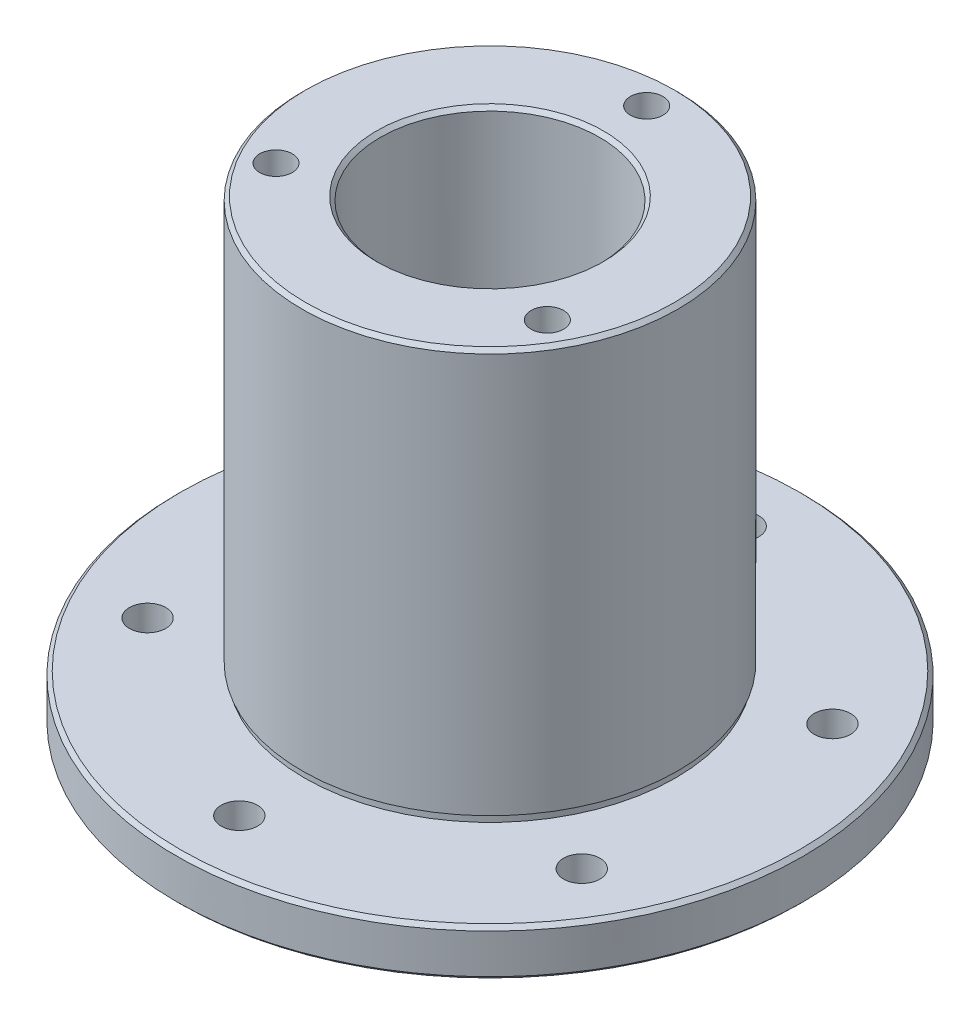
ISO-10303-21;
HEADER;
FILE_DESCRIPTION(('STEP AP214'),'2;1');
FILE_NAME('part.step','',(''),(''),'','','');
FILE_SCHEMA(('AUTOMOTIVE_DESIGN { 1 0 10303 214 1 1 1 1 }'));
ENDSEC;
DATA;
#1=APPLICATION_CONTEXT('core data for automotive mechanical design processes');
#2=APPLICATION_PROTOCOL_DEFINITION('international standard','automotive_design',2000,#1);
#3=PRODUCT_CONTEXT('',#1,'mechanical');
#4=PRODUCT('Part','Part','',(#3));
#5=PRODUCT_RELATED_PRODUCT_CATEGORY('part','',(#4));
#6=PRODUCT_DEFINITION_FORMATION('','',#4);
#7=PRODUCT_DEFINITION_CONTEXT('part definition',#1,'design');
#8=PRODUCT_DEFINITION('design','',#6,#7);
#9=PRODUCT_DEFINITION_SHAPE('','',#8);
#10=(LENGTH_UNIT() NAMED_UNIT(*) SI_UNIT(.MILLI.,.METRE.));
#11=(NAMED_UNIT(*) PLANE_ANGLE_UNIT() SI_UNIT($,.RADIAN.));
#12=(NAMED_UNIT(*) SI_UNIT($,.STERADIAN.) SOLID_ANGLE_UNIT());
#13=UNCERTAINTY_MEASURE_WITH_UNIT(LENGTH_MEASURE(1.E-05),#10,'distance_accuracy_value','');
#14=(GEOMETRIC_REPRESENTATION_CONTEXT(3) GLOBAL_UNCERTAINTY_ASSIGNED_CONTEXT((#13)) GLOBAL_UNIT_ASSIGNED_CONTEXT((#10,
#11,#12)) REPRESENTATION_CONTEXT('',''));
#15=CARTESIAN_POINT('',(0.,0.,0.));
#16=DIRECTION('',(0.,0.,1.));
#17=DIRECTION('',(1.,0.,0.));
#18=AXIS2_PLACEMENT_3D('',#15,#16,#17);
#19=CARTESIAN_POINT('',(-1.79709793685518,-24.5947682825804,0.));
#20=DIRECTION('',(0.,1.,0.));
#21=DIRECTION('',(0.,0.,1.));
#22=AXIS2_PLACEMENT_3D('',#19,#20,#21);
#23=CONICAL_SURFACE('',#22,31.749999999829,0.785398162500004);
#24=CARTESIAN_POINT('',(-1.79709793685518,-24.9757682829223,0.));
#25=DIRECTION('',(0.,1.,0.));
#26=DIRECTION('',(0.,0.,1.));
#27=AXIS2_PLACEMENT_3D('',#24,#25,#26);
#28=CIRCLE('',#27,31.369000000171);
#29=CARTESIAN_POINT('',(-1.79709793685518,-24.9757682829223,31.369000000171));
#30=VERTEX_POINT('',#29);
#31=EDGE_CURVE('E20',#30,#30,#28,.F.);
#32=ORIENTED_EDGE('',*,*,#31,.F.);
#33=EDGE_LOOP('',(#32));
#34=FACE_BOUND('',#33,.T.);
#35=CARTESIAN_POINT('',(-1.79709793685518,-24.5947682827513,0.));
#36=DIRECTION('',(0.,-1.,0.));
#37=DIRECTION('',(1.,0.,0.));
#38=AXIS2_PLACEMENT_3D('',#35,#36,#37);
#39=CIRCLE('',#38,31.75);
#40=CARTESIAN_POINT('',(29.9529020631448,-24.5947682827513,0.));
#41=VERTEX_POINT('',#40);
#42=EDGE_CURVE('E76',#41,#41,#39,.F.);
#43=ORIENTED_EDGE('',*,*,#42,.F.);
#44=EDGE_LOOP('',(#43));
#45=FACE_BOUND('',#44,.T.);
#46=ADVANCED_FACE('F17',(#34,#45),#23,.T.);
#47=CARTESIAN_POINT('',(-1.79709793685518,-22.5945182827513,0.));
#48=DIRECTION('',(0.,-1.,0.));
#49=DIRECTION('',(1.,0.,0.));
#50=AXIS2_PLACEMENT_3D('',#47,#48,#49);
#51=CYLINDRICAL_SURFACE('',#50,31.75);
#52=ORIENTED_EDGE('',*,*,#42,.T.);
#53=EDGE_LOOP('',(#52));
#54=FACE_BOUND('',#53,.T.);
#55=CARTESIAN_POINT('',(-1.79709793685518,-20.5942682829223,0.));
#56=DIRECTION('',(0.,-1.,0.));
#57=DIRECTION('',(-1.,0.,0.));
#58=AXIS2_PLACEMENT_3D('',#55,#56,#57);
#59=CIRCLE('',#58,31.749999999829);
#60=CARTESIAN_POINT('',(-33.5470979366842,-20.5942682829223,0.));
#61=VERTEX_POINT('',#60);
#62=EDGE_CURVE('E69',#61,#61,#59,.F.);
#63=ORIENTED_EDGE('',*,*,#62,.F.);
#64=EDGE_LOOP('',(#63));
#65=FACE_BOUND('',#64,.T.);
#66=ADVANCED_FACE('F148',(#54,#65),#51,.T.);
#67=CARTESIAN_POINT('',(14.0779020631448,-24.9757682827513,0.));
#68=DIRECTION('',(0.,-1.,0.));
#69=DIRECTION('',(0.,0.,-1.));
#70=AXIS2_PLACEMENT_3D('',#67,#68,#69);
#71=PLANE('',#70);
#72=CARTESIAN_POINT('',(-1.79709793685518,-24.9757682829223,0.));
#73=DIRECTION('',(0.,-1.,0.));
#74=DIRECTION('',(0.,0.,-1.));
#75=AXIS2_PLACEMENT_3D('',#72,#73,#74);
#76=CIRCLE('',#75,11.493499999829);
#77=CARTESIAN_POINT('',(-1.79709793685518,-24.9757682829223,-11.493499999829));
#78=VERTEX_POINT('',#77);
#79=EDGE_CURVE('E73',#78,#78,#76,.F.);
#80=ORIENTED_EDGE('',*,*,#79,.T.);
#81=EDGE_LOOP('',(#80));
#82=FACE_BOUND('',#81,.T.);
#83=CARTESIAN_POINT('',(-1.79709793685518,-24.9757682827513,25.4));
#84=DIRECTION('',(0.,-1.,0.));
#85=DIRECTION('',(1.,0.,0.));
#86=AXIS2_PLACEMENT_3D('',#83,#84,#85);
#87=CIRCLE('',#86,1.8415);
#88=CARTESIAN_POINT('',(0.0444020631448242,-24.9757682827513,25.4));
#89=VERTEX_POINT('',#88);
#90=EDGE_CURVE('E66',#89,#89,#87,.F.);
#91=ORIENTED_EDGE('',*,*,#90,.T.);
#92=EDGE_LOOP('',(#91));
#93=FACE_BOUND('',#92,.T.);
#94=CARTESIAN_POINT('',(-23.7941431929799,-24.9757682827513,12.7));
#95=DIRECTION('',(0.,-1.,0.));
#96=DIRECTION('',(0.,0.,-1.));
#97=AXIS2_PLACEMENT_3D('',#94,#95,#96);
#98=CIRCLE('',#97,1.8415);
#99=CARTESIAN_POINT('',(-23.7941431929799,-24.9757682827513,10.8585));
#100=VERTEX_POINT('',#99);
#101=EDGE_CURVE('E125',#100,#100,#98,.F.);
#102=ORIENTED_EDGE('',*,*,#101,.T.);
#103=EDGE_LOOP('',(#102));
#104=FACE_BOUND('',#103,.T.);
#105=CARTESIAN_POINT('',(-23.7941431929799,-24.9757682827513,-12.7));
#106=DIRECTION('',(0.,-1.,0.));
#107=DIRECTION('',(0.,0.,-1.));
#108=AXIS2_PLACEMENT_3D('',#105,#106,#107);
#109=CIRCLE('',#108,1.8415);
#110=CARTESIAN_POINT('',(-23.7941431929799,-24.9757682827513,-14.5415));
#111=VERTEX_POINT('',#110);
#112=EDGE_CURVE('E128',#111,#111,#109,.F.);
#113=ORIENTED_EDGE('',*,*,#112,.T.);
#114=EDGE_LOOP('',(#113));
#115=FACE_BOUND('',#114,.T.);
#116=CARTESIAN_POINT('',(-1.79709793685518,-24.9757682827513,-25.4));
#117=DIRECTION('',(0.,-1.,0.));
#118=DIRECTION('',(1.,0.,0.));
#119=AXIS2_PLACEMENT_3D('',#116,#117,#118);
#120=CIRCLE('',#119,1.8415);
#121=CARTESIAN_POINT('',(0.0444020631448151,-24.9757682827513,-25.4));
#122=VERTEX_POINT('',#121);
#123=EDGE_CURVE('E131',#122,#122,#120,.F.);
#124=ORIENTED_EDGE('',*,*,#123,.T.);
#125=EDGE_LOOP('',(#124));
#126=FACE_BOUND('',#125,.T.);
#127=CARTESIAN_POINT('',(20.1999473192696,-24.9757682827513,-12.7));
#128=DIRECTION('',(0.,-1.,0.));
#129=DIRECTION('',(0.,0.,-1.));
#130=AXIS2_PLACEMENT_3D('',#127,#128,#129);
#131=CIRCLE('',#130,1.8415);
#132=CARTESIAN_POINT('',(20.1999473192696,-24.9757682827513,-14.5415));
#133=VERTEX_POINT('',#132);
#134=EDGE_CURVE('E134',#133,#133,#131,.F.);
#135=ORIENTED_EDGE('',*,*,#134,.T.);
#136=EDGE_LOOP('',(#135));
#137=FACE_BOUND('',#136,.T.);
#138=CARTESIAN_POINT('',(20.1999473192696,-24.9757682827513,12.7));
#139=DIRECTION('',(0.,-1.,0.));
#140=DIRECTION('',(0.,0.,-1.));
#141=AXIS2_PLACEMENT_3D('',#138,#139,#140);
#142=CIRCLE('',#141,1.8415);
#143=CARTESIAN_POINT('',(20.1999473192696,-24.9757682827513,10.8585));
#144=VERTEX_POINT('',#143);
#145=EDGE_CURVE('E72',#144,#144,#142,.F.);
#146=ORIENTED_EDGE('',*,*,#145,.T.);
#147=EDGE_LOOP('',(#146));
#148=FACE_BOUND('',#147,.T.);
#149=ORIENTED_EDGE('',*,*,#31,.T.);
#150=EDGE_LOOP('',(#149));
#151=FACE_BOUND('',#150,.T.);
#152=ADVANCED_FACE('F144',(#82,#93,#104,#115,#126,#137,#148,#151),#71,.T.);
#153=CARTESIAN_POINT('',(-1.79709793685518,-24.9757682829223,0.));
#154=DIRECTION('',(0.,-1.,0.));
#155=DIRECTION('',(0.,0.,-1.));
#156=AXIS2_PLACEMENT_3D('',#153,#154,#155);
#157=CONICAL_SURFACE('',#156,11.493499999829,0.785398162500013);
#158=ORIENTED_EDGE('',*,*,#79,.F.);
#159=EDGE_LOOP('',(#158));
#160=FACE_BOUND('',#159,.T.);
#161=CARTESIAN_POINT('',(-1.79709793685517,-24.5947682827513,0.));
#162=DIRECTION('',(0.,1.,0.));
#163=DIRECTION('',(-1.,0.,0.));
#164=AXIS2_PLACEMENT_3D('',#161,#162,#163);
#165=CIRCLE('',#164,11.1125);
#166=CARTESIAN_POINT('',(-12.9095979368552,-24.5947682827513,0.));
#167=VERTEX_POINT('',#166);
#168=EDGE_CURVE('E62',#167,#167,#165,.T.);
#169=ORIENTED_EDGE('',*,*,#168,.T.);
#170=EDGE_LOOP('',(#169));
#171=FACE_BOUND('',#170,.T.);
#172=ADVANCED_FACE('F159',(#160,#171),#157,.F.);
#173=CARTESIAN_POINT('',(-1.79709793685518,-20.5942682829223,0.));
#174=DIRECTION('',(0.,-1.,0.));
#175=DIRECTION('',(0.,0.,-1.));
#176=AXIS2_PLACEMENT_3D('',#173,#174,#175);
#177=CONICAL_SURFACE('',#176,31.749999999829,0.785398162499995);
#178=ORIENTED_EDGE('',*,*,#62,.T.);
#179=EDGE_LOOP('',(#178));
#180=FACE_BOUND('',#179,.T.);
#181=CARTESIAN_POINT('',(-1.79709793685518,-20.2132682825803,0.));
#182=DIRECTION('',(0.,-1.,0.));
#183=DIRECTION('',(0.,0.,-1.));
#184=AXIS2_PLACEMENT_3D('',#181,#182,#183);
#185=CIRCLE('',#184,31.369000000171);
#186=CARTESIAN_POINT('',(-1.79709793685518,-20.2132682825803,-31.369000000171));
#187=VERTEX_POINT('',#186);
#188=EDGE_CURVE('E65',#187,#187,#185,.F.);
#189=ORIENTED_EDGE('',*,*,#188,.F.);
#190=EDGE_LOOP('',(#189));
#191=FACE_BOUND('',#190,.T.);
#192=ADVANCED_FACE('F155',(#180,#191),#177,.T.);
#193=CARTESIAN_POINT('',(20.1999473192696,76.1141775192423,12.7));
#194=DIRECTION('',(0.,-1.,0.));
#195=DIRECTION('',(0.,0.,-1.));
#196=AXIS2_PLACEMENT_3D('',#193,#194,#195);
#197=CYLINDRICAL_SURFACE('',#196,1.8415);
#198=ORIENTED_EDGE('',*,*,#145,.F.);
#199=EDGE_LOOP('',(#198));
#200=FACE_BOUND('',#199,.T.);
#201=CARTESIAN_POINT('',(20.1999473192696,-20.2132682827513,12.7));
#202=DIRECTION('',(0.,-1.,0.));
#203=DIRECTION('',(0.,0.,-1.));
#204=AXIS2_PLACEMENT_3D('',#201,#202,#203);
#205=CIRCLE('',#204,1.8415);
#206=CARTESIAN_POINT('',(20.1999473192696,-20.2132682827513,10.8585));
#207=VERTEX_POINT('',#206);
#208=EDGE_CURVE('E118',#207,#207,#205,.T.);
#209=ORIENTED_EDGE('',*,*,#208,.F.);
#210=EDGE_LOOP('',(#209));
#211=FACE_BOUND('',#210,.T.);
#212=ADVANCED_FACE('F158',(#200,#211),#197,.F.);
#213=CARTESIAN_POINT('',(20.1999473192696,76.1141775192423,-12.7));
#214=DIRECTION('',(0.,-1.,0.));
#215=DIRECTION('',(0.,0.,-1.));
#216=AXIS2_PLACEMENT_3D('',#213,#214,#215);
#217=CYLINDRICAL_SURFACE('',#216,1.8415);
#218=ORIENTED_EDGE('',*,*,#134,.F.);
#219=EDGE_LOOP('',(#218));
#220=FACE_BOUND('',#219,.T.);
#221=CARTESIAN_POINT('',(20.1999473192696,-20.2132682827513,-12.7));
#222=DIRECTION('',(0.,-1.,0.));
#223=DIRECTION('',(0.,0.,-1.));
#224=AXIS2_PLACEMENT_3D('',#221,#222,#223);
#225=CIRCLE('',#224,1.8415);
#226=CARTESIAN_POINT('',(20.1999473192696,-20.2132682827513,-14.5415));
#227=VERTEX_POINT('',#226);
#228=EDGE_CURVE('E115',#227,#227,#225,.T.);
#229=ORIENTED_EDGE('',*,*,#228,.F.);
#230=EDGE_LOOP('',(#229));
#231=FACE_BOUND('',#230,.T.);
#232=ADVANCED_FACE('F249',(#220,#231),#217,.F.);
#233=CARTESIAN_POINT('',(-1.79709793685515,76.1141775192423,-25.4));
#234=DIRECTION('',(0.,-1.,0.));
#235=DIRECTION('',(1.,0.,0.));
#236=AXIS2_PLACEMENT_3D('',#233,#234,#235);
#237=CYLINDRICAL_SURFACE('',#236,1.8415);
#238=ORIENTED_EDGE('',*,*,#123,.F.);
#239=EDGE_LOOP('',(#238));
#240=FACE_BOUND('',#239,.T.);
#241=CARTESIAN_POINT('',(-1.79709793685518,-20.2132682827513,-25.4));
#242=DIRECTION('',(0.,-1.,0.));
#243=DIRECTION('',(1.,0.,0.));
#244=AXIS2_PLACEMENT_3D('',#241,#242,#243);
#245=CIRCLE('',#244,1.8415);
#246=CARTESIAN_POINT('',(0.0444020631448164,-20.2132682827513,-25.4));
#247=VERTEX_POINT('',#246);
#248=EDGE_CURVE('E112',#247,#247,#245,.T.);
#249=ORIENTED_EDGE('',*,*,#248,.F.);
#250=EDGE_LOOP('',(#249));
#251=FACE_BOUND('',#250,.T.);
#252=ADVANCED_FACE('F245',(#240,#251),#237,.F.);
#253=CARTESIAN_POINT('',(-23.7941431929799,76.1141775192423,-12.7));
#254=DIRECTION('',(0.,-1.,0.));
#255=DIRECTION('',(0.,0.,-1.));
#256=AXIS2_PLACEMENT_3D('',#253,#254,#255);
#257=CYLINDRICAL_SURFACE('',#256,1.8415);
#258=ORIENTED_EDGE('',*,*,#112,.F.);
#259=EDGE_LOOP('',(#258));
#260=FACE_BOUND('',#259,.T.);
#261=CARTESIAN_POINT('',(-23.7941431929799,-20.2132682827513,-12.7));
#262=DIRECTION('',(0.,-1.,0.));
#263=DIRECTION('',(0.,0.,-1.));
#264=AXIS2_PLACEMENT_3D('',#261,#262,#263);
#265=CIRCLE('',#264,1.8415);
#266=CARTESIAN_POINT('',(-23.7941431929799,-20.2132682827513,-14.5415));
#267=VERTEX_POINT('',#266);
#268=EDGE_CURVE('E109',#267,#267,#265,.T.);
#269=ORIENTED_EDGE('',*,*,#268,.F.);
#270=EDGE_LOOP('',(#269));
#271=FACE_BOUND('',#270,.T.);
#272=ADVANCED_FACE('F241',(#260,#271),#257,.F.);
#273=CARTESIAN_POINT('',(-23.7941431929799,76.1141775192423,12.7));
#274=DIRECTION('',(0.,-1.,0.));
#275=DIRECTION('',(0.,0.,-1.));
#276=AXIS2_PLACEMENT_3D('',#273,#274,#275);
#277=CYLINDRICAL_SURFACE('',#276,1.8415);
#278=ORIENTED_EDGE('',*,*,#101,.F.);
#279=EDGE_LOOP('',(#278));
#280=FACE_BOUND('',#279,.T.);
#281=CARTESIAN_POINT('',(-23.7941431929799,-20.2132682827513,12.7));
#282=DIRECTION('',(0.,-1.,0.));
#283=DIRECTION('',(0.,0.,-1.));
#284=AXIS2_PLACEMENT_3D('',#281,#282,#283);
#285=CIRCLE('',#284,1.8415);
#286=CARTESIAN_POINT('',(-23.7941431929799,-20.2132682827513,10.8585));
#287=VERTEX_POINT('',#286);
#288=EDGE_CURVE('E106',#287,#287,#285,.T.);
#289=ORIENTED_EDGE('',*,*,#288,.F.);
#290=EDGE_LOOP('',(#289));
#291=FACE_BOUND('',#290,.T.);
#292=ADVANCED_FACE('F233',(#280,#291),#277,.F.);
#293=CARTESIAN_POINT('',(-1.79709793685521,76.1141775192423,25.4));
#294=DIRECTION('',(0.,-1.,0.));
#295=DIRECTION('',(1.,0.,0.));
#296=AXIS2_PLACEMENT_3D('',#293,#294,#295);
#297=CYLINDRICAL_SURFACE('',#296,1.8415);
#298=ORIENTED_EDGE('',*,*,#90,.F.);
#299=EDGE_LOOP('',(#298));
#300=FACE_BOUND('',#299,.T.);
#301=CARTESIAN_POINT('',(-1.79709793685518,-20.2132682827513,25.4));
#302=DIRECTION('',(0.,-1.,0.));
#303=DIRECTION('',(1.,0.,0.));
#304=AXIS2_PLACEMENT_3D('',#301,#302,#303);
#305=CIRCLE('',#304,1.8415);
#306=CARTESIAN_POINT('',(0.044402063144823,-20.2132682827513,25.4));
#307=VERTEX_POINT('',#306);
#308=EDGE_CURVE('E53',#307,#307,#305,.T.);
#309=ORIENTED_EDGE('',*,*,#308,.F.);
#310=EDGE_LOOP('',(#309));
#311=FACE_BOUND('',#310,.T.);
#312=ADVANCED_FACE('F227',(#300,#311),#297,.F.);
#313=CARTESIAN_POINT('',(-1.79709793685515,-79.6472140847449,0.));
#314=DIRECTION('',(0.,1.,0.));
#315=DIRECTION('',(-1.,0.,0.));
#316=AXIS2_PLACEMENT_3D('',#313,#314,#315);
#317=CYLINDRICAL_SURFACE('',#316,11.1125);
#318=ORIENTED_EDGE('',*,*,#168,.F.);
#319=EDGE_LOOP('',(#318));
#320=FACE_BOUND('',#319,.T.);
#321=CARTESIAN_POINT('',(-1.79709793685518,21.0617317170777,0.));
#322=DIRECTION('',(0.,1.,0.));
#323=DIRECTION('',(1.,0.,0.));
#324=AXIS2_PLACEMENT_3D('',#321,#322,#323);
#325=CIRCLE('',#324,11.112500000171);
#326=CARTESIAN_POINT('',(9.31540206331578,21.0617317170777,0.));
#327=VERTEX_POINT('',#326);
#328=EDGE_CURVE('E47',#327,#327,#325,.T.);
#329=ORIENTED_EDGE('',*,*,#328,.T.);
#330=EDGE_LOOP('',(#329));
#331=FACE_BOUND('',#330,.T.);
#332=ADVANCED_FACE('F40',(#320,#331),#317,.F.);
#333=CARTESIAN_POINT('',(11.9510553482228,2.39273171814602,7.9375));
#334=DIRECTION('',(0.,1.,0.));
#335=DIRECTION('',(-1.,0.,0.));
#336=AXIS2_PLACEMENT_3D('',#333,#334,#335);
#337=CONICAL_SURFACE('',#336,1.65099999929635,1.02974425749618);
#338=CARTESIAN_POINT('',(11.9510553482769,1.40071083393423,7.9375));
#339=VERTEX_POINT('',#338);
#340=VERTEX_LOOP('',#339);
#341=FACE_BOUND('',#340,.T.);
#342=CARTESIAN_POINT('',(11.9510553482228,2.39273171724869,7.9375));
#343=DIRECTION('',(0.,1.,0.));
#344=DIRECTION('',(-1.,0.,0.));
#345=AXIS2_PLACEMENT_3D('',#342,#343,#344);
#346=CIRCLE('',#345,1.651);
#347=CARTESIAN_POINT('',(10.3000553482228,2.39273171724869,7.9375));
#348=VERTEX_POINT('',#347);
#349=EDGE_CURVE('E44',#348,#348,#346,.T.);
#350=ORIENTED_EDGE('',*,*,#349,.T.);
#351=EDGE_LOOP('',(#350));
#352=FACE_BOUND('',#351,.T.);
#353=ADVANCED_FACE('F36',(#341,#352),#337,.F.);
#354=CARTESIAN_POINT('',(-15.5452512219331,2.39273171820287,7.9375));
#355=DIRECTION('',(0.,1.,0.));
#356=DIRECTION('',(-1.,0.,0.));
#357=AXIS2_PLACEMENT_3D('',#354,#355,#356);
#358=CONICAL_SURFACE('',#357,1.65099999949422,1.02974425742335);
#359=CARTESIAN_POINT('',(-15.5452512220791,1.4007108337637,7.9375));
#360=VERTEX_POINT('',#359);
#361=VERTEX_LOOP('',#360);
#362=FACE_BOUND('',#361,.T.);
#363=CARTESIAN_POINT('',(-15.5452512219331,2.39273171724869,7.9375));
#364=DIRECTION('',(0.,1.,0.));
#365=DIRECTION('',(-1.,0.,0.));
#366=AXIS2_PLACEMENT_3D('',#363,#364,#365);
#367=CIRCLE('',#366,1.651);
#368=CARTESIAN_POINT('',(-17.1962512219331,2.39273171724869,7.9375));
#369=VERTEX_POINT('',#368);
#370=EDGE_CURVE('E46',#369,#369,#367,.T.);
#371=ORIENTED_EDGE('',*,*,#370,.T.);
#372=EDGE_LOOP('',(#371));
#373=FACE_BOUND('',#372,.T.);
#374=ADVANCED_FACE('F39',(#362,#373),#358,.F.);
#375=CARTESIAN_POINT('',(-1.79709793685518,2.39273171814602,-15.875));
#376=DIRECTION('',(0.,1.,0.));
#377=DIRECTION('',(-1.,0.,0.));
#378=AXIS2_PLACEMENT_3D('',#375,#376,#377);
#379=CONICAL_SURFACE('',#378,1.65099999931002,1.02974425743624);
#380=CARTESIAN_POINT('',(-1.79709793695793,1.40071083382054,-15.875));
#381=VERTEX_POINT('',#380);
#382=VERTEX_LOOP('',#381);
#383=FACE_BOUND('',#382,.T.);
#384=CARTESIAN_POINT('',(-1.79709793685518,2.39273171724869,-15.875));
#385=DIRECTION('',(0.,1.,0.));
#386=DIRECTION('',(-1.,0.,0.));
#387=AXIS2_PLACEMENT_3D('',#384,#385,#386);
#388=CIRCLE('',#387,1.651);
#389=CARTESIAN_POINT('',(-3.44809793685518,2.39273171724869,-15.875));
#390=VERTEX_POINT('',#389);
#391=EDGE_CURVE('E50',#390,#390,#388,.T.);
#392=ORIENTED_EDGE('',*,*,#391,.T.);
#393=EDGE_LOOP('',(#392));
#394=FACE_BOUND('',#393,.T.);
#395=ADVANCED_FACE('F166',(#383,#394),#379,.F.);
#396=CARTESIAN_POINT('',(23.6029020631449,-20.2132682827513,0.));
#397=DIRECTION('',(0.,1.,0.));
#398=DIRECTION('',(0.,0.,1.));
#399=AXIS2_PLACEMENT_3D('',#396,#397,#398);
#400=PLANE('',#399);
#401=CARTESIAN_POINT('',(-1.79709793685518,-20.2132682827513,0.));
#402=DIRECTION('',(0.,-1.,0.));
#403=DIRECTION('',(1.,0.,0.));
#404=AXIS2_PLACEMENT_3D('',#401,#402,#403);
#405=CIRCLE('',#404,18.796);
#406=CARTESIAN_POINT('',(16.9989020631448,-20.2132682827513,0.));
#407=VERTEX_POINT('',#406);
#408=EDGE_CURVE('E101',#407,#407,#405,.F.);
#409=ORIENTED_EDGE('',*,*,#408,.F.);
#410=EDGE_LOOP('',(#409));
#411=FACE_BOUND('',#410,.T.);
#412=ORIENTED_EDGE('',*,*,#308,.T.);
#413=EDGE_LOOP('',(#412));
#414=FACE_BOUND('',#413,.T.);
#415=ORIENTED_EDGE('',*,*,#288,.T.);
#416=EDGE_LOOP('',(#415));
#417=FACE_BOUND('',#416,.T.);
#418=ORIENTED_EDGE('',*,*,#268,.T.);
#419=EDGE_LOOP('',(#418));
#420=FACE_BOUND('',#419,.T.);
#421=ORIENTED_EDGE('',*,*,#248,.T.);
#422=EDGE_LOOP('',(#421));
#423=FACE_BOUND('',#422,.T.);
#424=ORIENTED_EDGE('',*,*,#228,.T.);
#425=EDGE_LOOP('',(#424));
#426=FACE_BOUND('',#425,.T.);
#427=ORIENTED_EDGE('',*,*,#208,.T.);
#428=EDGE_LOOP('',(#427));
#429=FACE_BOUND('',#428,.T.);
#430=ORIENTED_EDGE('',*,*,#188,.T.);
#431=EDGE_LOOP('',(#430));
#432=FACE_BOUND('',#431,.T.);
#433=ADVANCED_FACE('F163',(#411,#414,#417,#420,#423,#426,#429,#432),#400,.T.);
#434=CARTESIAN_POINT('',(-1.79709793685518,21.4427317174197,0.));
#435=DIRECTION('',(0.,1.,0.));
#436=DIRECTION('',(0.,0.,1.));
#437=AXIS2_PLACEMENT_3D('',#434,#435,#436);
#438=CONICAL_SURFACE('',#437,11.493499999829,0.785398162500004);
#439=CARTESIAN_POINT('',(-1.79709793685518,21.4427317174197,0.));
#440=DIRECTION('',(0.,1.,0.));
#441=DIRECTION('',(0.,0.,1.));
#442=AXIS2_PLACEMENT_3D('',#439,#440,#441);
#443=CIRCLE('',#442,11.493499999829);
#444=CARTESIAN_POINT('',(-1.79709793685518,21.4427317174197,11.493499999829));
#445=VERTEX_POINT('',#444);
#446=EDGE_CURVE('E98',#445,#445,#443,.F.);
#447=ORIENTED_EDGE('',*,*,#446,.F.);
#448=EDGE_LOOP('',(#447));
#449=FACE_BOUND('',#448,.T.);
#450=ORIENTED_EDGE('',*,*,#328,.F.);
#451=EDGE_LOOP('',(#450));
#452=FACE_BOUND('',#451,.T.);
#453=ADVANCED_FACE('F165',(#449,#452),#438,.F.);
#454=CARTESIAN_POINT('',(11.9510553482228,11.9177317172487,7.9375));
#455=DIRECTION('',(0.,1.,0.));
#456=DIRECTION('',(-1.,0.,0.));
#457=AXIS2_PLACEMENT_3D('',#454,#455,#456);
#458=CYLINDRICAL_SURFACE('',#457,1.651);
#459=ORIENTED_EDGE('',*,*,#349,.F.);
#460=EDGE_LOOP('',(#459));
#461=FACE_BOUND('',#460,.T.);
#462=CARTESIAN_POINT('',(11.9510553482228,21.4427317172487,7.9375));
#463=DIRECTION('',(0.,1.,0.));
#464=DIRECTION('',(-1.,0.,0.));
#465=AXIS2_PLACEMENT_3D('',#462,#463,#464);
#466=CIRCLE('',#465,1.651);
#467=CARTESIAN_POINT('',(10.3000553482228,21.4427317172487,7.9375));
#468=VERTEX_POINT('',#467);
#469=EDGE_CURVE('E95',#468,#468,#466,.F.);
#470=ORIENTED_EDGE('',*,*,#469,.F.);
#471=EDGE_LOOP('',(#470));
#472=FACE_BOUND('',#471,.T.);
#473=ADVANCED_FACE('F174',(#461,#472),#458,.F.);
#474=CARTESIAN_POINT('',(-15.5452512219331,11.9177317172487,7.9375));
#475=DIRECTION('',(0.,1.,0.));
#476=DIRECTION('',(-1.,0.,0.));
#477=AXIS2_PLACEMENT_3D('',#474,#475,#476);
#478=CYLINDRICAL_SURFACE('',#477,1.651);
#479=ORIENTED_EDGE('',*,*,#370,.F.);
#480=EDGE_LOOP('',(#479));
#481=FACE_BOUND('',#480,.T.);
#482=CARTESIAN_POINT('',(-15.5452512219331,21.4427317172487,7.9375));
#483=DIRECTION('',(0.,1.,0.));
#484=DIRECTION('',(-1.,0.,0.));
#485=AXIS2_PLACEMENT_3D('',#482,#483,#484);
#486=CIRCLE('',#485,1.651);
#487=CARTESIAN_POINT('',(-17.1962512219331,21.4427317172487,7.9375));
#488=VERTEX_POINT('',#487);
#489=EDGE_CURVE('E92',#488,#488,#486,.F.);
#490=ORIENTED_EDGE('',*,*,#489,.F.);
#491=EDGE_LOOP('',(#490));
#492=FACE_BOUND('',#491,.T.);
#493=ADVANCED_FACE('F207',(#481,#492),#478,.F.);
#494=CARTESIAN_POINT('',(-1.79709793685518,11.9177317172487,-15.875));
#495=DIRECTION('',(0.,1.,0.));
#496=DIRECTION('',(-1.,0.,0.));
#497=AXIS2_PLACEMENT_3D('',#494,#495,#496);
#498=CYLINDRICAL_SURFACE('',#497,1.651);
#499=ORIENTED_EDGE('',*,*,#391,.F.);
#500=EDGE_LOOP('',(#499));
#501=FACE_BOUND('',#500,.T.);
#502=CARTESIAN_POINT('',(-1.79709793685518,21.4427317172487,-15.875));
#503=DIRECTION('',(0.,1.,0.));
#504=DIRECTION('',(-1.,0.,0.));
#505=AXIS2_PLACEMENT_3D('',#502,#503,#504);
#506=CIRCLE('',#505,1.651);
#507=CARTESIAN_POINT('',(-3.44809793685518,21.4427317172487,-15.875));
#508=VERTEX_POINT('',#507);
#509=EDGE_CURVE('E89',#508,#508,#506,.F.);
#510=ORIENTED_EDGE('',*,*,#509,.F.);
#511=EDGE_LOOP('',(#510));
#512=FACE_BOUND('',#511,.T.);
#513=ADVANCED_FACE('F203',(#501,#512),#498,.F.);
#514=CARTESIAN_POINT('',(-1.79709793685518,-19.8322682827513,0.));
#515=DIRECTION('',(0.,-1.,0.));
#516=DIRECTION('',(1.,0.,0.));
#517=AXIS2_PLACEMENT_3D('',#514,#515,#516);
#518=CYLINDRICAL_SURFACE('',#517,18.796);
#519=CARTESIAN_POINT('',(-1.79709793685518,-19.4512682827513,0.));
#520=DIRECTION('',(0.,-1.,0.));
#521=DIRECTION('',(1.,0.,0.));
#522=AXIS2_PLACEMENT_3D('',#519,#520,#521);
#523=CIRCLE('',#522,18.796);
#524=CARTESIAN_POINT('',(16.9989020631448,-19.4512682827513,0.));
#525=VERTEX_POINT('',#524);
#526=EDGE_CURVE('E86',#525,#525,#523,.F.);
#527=ORIENTED_EDGE('',*,*,#526,.F.);
#528=EDGE_LOOP('',(#527));
#529=FACE_BOUND('',#528,.T.);
#530=ORIENTED_EDGE('',*,*,#408,.T.);
#531=EDGE_LOOP('',(#530));
#532=FACE_BOUND('',#531,.T.);
#533=ADVANCED_FACE('F199',(#529,#532),#518,.T.);
#534=CARTESIAN_POINT('',(7.72790206314482,21.4427317172487,0.));
#535=DIRECTION('',(0.,1.,0.));
#536=DIRECTION('',(0.,0.,1.));
#537=AXIS2_PLACEMENT_3D('',#534,#535,#536);
#538=PLANE('',#537);
#539=ORIENTED_EDGE('',*,*,#509,.T.);
#540=EDGE_LOOP('',(#539));
#541=FACE_BOUND('',#540,.T.);
#542=ORIENTED_EDGE('',*,*,#489,.T.);
#543=EDGE_LOOP('',(#542));
#544=FACE_BOUND('',#543,.T.);
#545=ORIENTED_EDGE('',*,*,#469,.T.);
#546=EDGE_LOOP('',(#545));
#547=FACE_BOUND('',#546,.T.);
#548=ORIENTED_EDGE('',*,*,#446,.T.);
#549=EDGE_LOOP('',(#548));
#550=FACE_BOUND('',#549,.T.);
#551=CARTESIAN_POINT('',(-1.79709793685518,21.4427317174197,0.));
#552=DIRECTION('',(0.,-1.,0.));
#553=DIRECTION('',(0.,0.,-1.));
#554=AXIS2_PLACEMENT_3D('',#551,#552,#553);
#555=CIRCLE('',#554,18.669000000171);
#556=CARTESIAN_POINT('',(-1.79709793685518,21.4427317174197,-18.669000000171));
#557=VERTEX_POINT('',#556);
#558=EDGE_CURVE('E83',#557,#557,#555,.T.);
#559=ORIENTED_EDGE('',*,*,#558,.F.);
#560=EDGE_LOOP('',(#559));
#561=FACE_BOUND('',#560,.T.);
#562=ADVANCED_FACE('F195',(#541,#544,#547,#550,#561),#538,.T.);
#563=CARTESIAN_POINT('',(17.1259020631448,-19.4512682827513,0.));
#564=DIRECTION('',(0.,-1.,0.));
#565=DIRECTION('',(0.,0.,-1.));
#566=AXIS2_PLACEMENT_3D('',#563,#564,#565);
#567=PLANE('',#566);
#568=ORIENTED_EDGE('',*,*,#526,.T.);
#569=EDGE_LOOP('',(#568));
#570=FACE_BOUND('',#569,.T.);
#571=CARTESIAN_POINT('',(-1.79709793685517,-19.4512682827513,0.));
#572=DIRECTION('',(0.,-1.,0.));
#573=DIRECTION('',(1.,0.,0.));
#574=AXIS2_PLACEMENT_3D('',#571,#572,#573);
#575=CIRCLE('',#574,19.05);
#576=CARTESIAN_POINT('',(17.2529020631448,-19.4512682827513,0.));
#577=VERTEX_POINT('',#576);
#578=EDGE_CURVE('E26',#577,#577,#575,.F.);
#579=ORIENTED_EDGE('',*,*,#578,.F.);
#580=EDGE_LOOP('',(#579));
#581=FACE_BOUND('',#580,.T.);
#582=ADVANCED_FACE('F188',(#570,#581),#567,.T.);
#583=CARTESIAN_POINT('',(-1.79709793685518,21.0617317170777,0.));
#584=DIRECTION('',(0.,-1.,0.));
#585=DIRECTION('',(0.,0.,-1.));
#586=AXIS2_PLACEMENT_3D('',#583,#584,#585);
#587=CONICAL_SURFACE('',#586,19.049999999829,0.785398162499995);
#588=CARTESIAN_POINT('',(-1.79709793685519,21.0617317172487,0.));
#589=DIRECTION('',(0.,-1.,0.));
#590=DIRECTION('',(1.,0.,0.));
#591=AXIS2_PLACEMENT_3D('',#588,#589,#590);
#592=CIRCLE('',#591,19.05);
#593=CARTESIAN_POINT('',(17.2529020631448,21.0617317172487,0.));
#594=VERTEX_POINT('',#593);
#595=EDGE_CURVE('E11',#594,#594,#592,.T.);
#596=ORIENTED_EDGE('',*,*,#595,.F.);
#597=EDGE_LOOP('',(#596));
#598=FACE_BOUND('',#597,.T.);
#599=ORIENTED_EDGE('',*,*,#558,.T.);
#600=EDGE_LOOP('',(#599));
#601=FACE_BOUND('',#600,.T.);
#602=ADVANCED_FACE('F182',(#598,#601),#587,.T.);
#603=CARTESIAN_POINT('',(-1.79709793685518,0.995731717248686,0.));
#604=DIRECTION('',(0.,-1.,0.));
#605=DIRECTION('',(1.,0.,0.));
#606=AXIS2_PLACEMENT_3D('',#603,#604,#605);
#607=CYLINDRICAL_SURFACE('',#606,19.05);
#608=ORIENTED_EDGE('',*,*,#595,.T.);
#609=EDGE_LOOP('',(#608));
#610=FACE_BOUND('',#609,.T.);
#611=ORIENTED_EDGE('',*,*,#578,.T.);
#612=EDGE_LOOP('',(#611));
#613=FACE_BOUND('',#612,.T.);
#614=ADVANCED_FACE('F180',(#610,#613),#607,.T.);
#615=CLOSED_SHELL('',(#46,#66,#152,#172,#192,#212,#232,#252,#272,#292,#312,#332,#353,#374,#395,
#433,#453,#473,#493,#513,#533,#562,#582,#602,#614));
#616=MANIFOLD_SOLID_BREP('B1',#615);
#617=ADVANCED_BREP_SHAPE_REPRESENTATION('',(#18,#616),#14);
#618=SHAPE_DEFINITION_REPRESENTATION(#9,#617);
ENDSEC;
END-ISO-10303-21;
